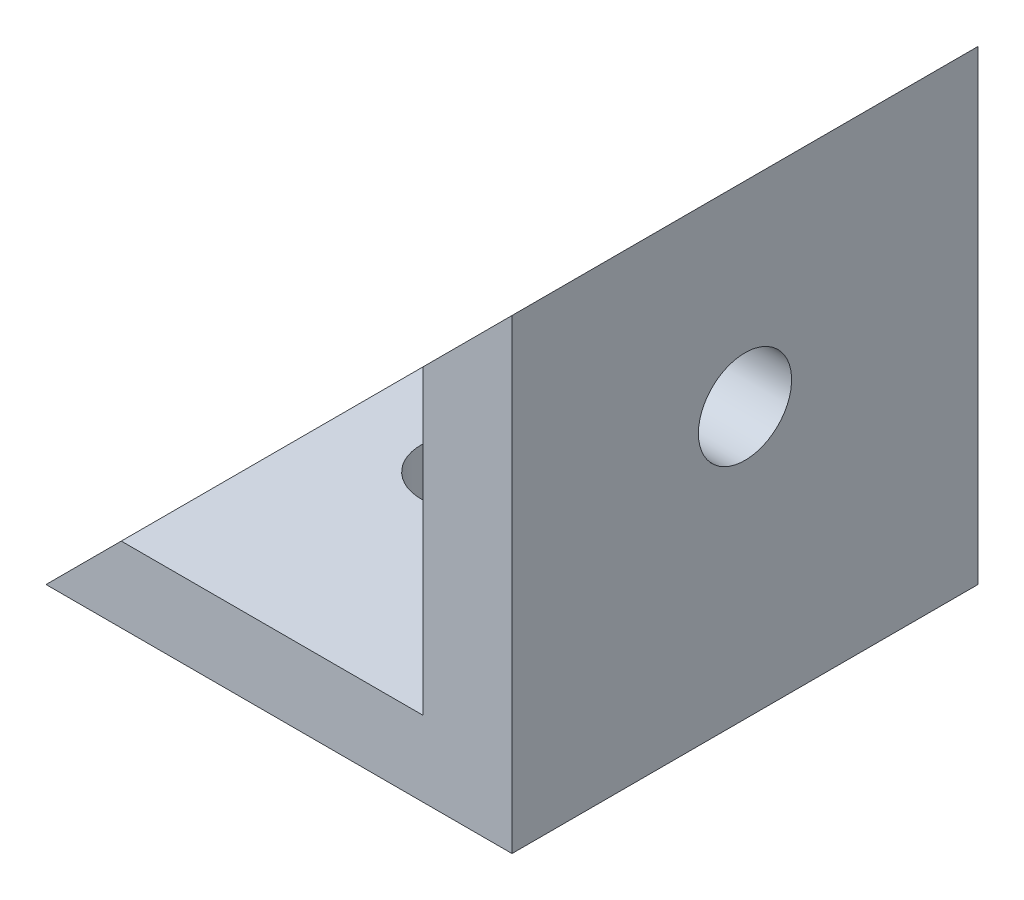
ISO-10303-21;
HEADER;
FILE_DESCRIPTION(('STEP AP214'),'2;1');
FILE_NAME('part.step','',(''),(''),'','','');
FILE_SCHEMA(('AUTOMOTIVE_DESIGN { 1 0 10303 214 1 1 1 1 }'));
ENDSEC;
DATA;
#1=APPLICATION_CONTEXT('core data for automotive mechanical design processes');
#2=APPLICATION_PROTOCOL_DEFINITION('international standard','automotive_design',2000,#1);
#3=PRODUCT_CONTEXT('',#1,'mechanical');
#4=PRODUCT('Part','Part','',(#3));
#5=PRODUCT_RELATED_PRODUCT_CATEGORY('part','',(#4));
#6=PRODUCT_DEFINITION_FORMATION('','',#4);
#7=PRODUCT_DEFINITION_CONTEXT('part definition',#1,'design');
#8=PRODUCT_DEFINITION('design','',#6,#7);
#9=PRODUCT_DEFINITION_SHAPE('','',#8);
#10=(LENGTH_UNIT() NAMED_UNIT(*) SI_UNIT(.MILLI.,.METRE.));
#11=(NAMED_UNIT(*) PLANE_ANGLE_UNIT() SI_UNIT($,.RADIAN.));
#12=(NAMED_UNIT(*) SI_UNIT($,.STERADIAN.) SOLID_ANGLE_UNIT());
#13=UNCERTAINTY_MEASURE_WITH_UNIT(LENGTH_MEASURE(1.E-05),#10,'distance_accuracy_value','');
#14=(GEOMETRIC_REPRESENTATION_CONTEXT(3) GLOBAL_UNCERTAINTY_ASSIGNED_CONTEXT((#13)) GLOBAL_UNIT_ASSIGNED_CONTEXT((#10,
#11,#12)) REPRESENTATION_CONTEXT('',''));
#15=CARTESIAN_POINT('',(0.,0.,0.));
#16=DIRECTION('',(0.,0.,1.));
#17=DIRECTION('',(1.,0.,0.));
#18=AXIS2_PLACEMENT_3D('',#15,#16,#17);
#19=CARTESIAN_POINT('',(-3.17275641148481,4.37791702596532,0.));
#20=DIRECTION('',(0.707106781186548,-0.707106781186548,0.));
#21=DIRECTION('',(0.707106781186548,0.707106781186548,0.));
#22=AXIS2_PLACEMENT_3D('',#19,#20,#21);
#23=PLANE('',#22);
#24=DIRECTION('',(0.,0.,1.));
#25=VECTOR('',#24,1.);
#26=CARTESIAN_POINT('',(-19.9426643462153,-12.3919909087651,0.));
#27=LINE('',#26,#25);
#28=CARTESIAN_POINT('',(-19.9426643462153,-12.3919909087651,0.));
#29=VERTEX_POINT('',#28);
#30=CARTESIAN_POINT('',(-19.9426643462153,-12.3919909087651,20.));
#31=VERTEX_POINT('',#30);
#32=EDGE_CURVE('E56',#29,#31,#27,.T.);
#33=ORIENTED_EDGE('',*,*,#32,.F.);
#34=DIRECTION('',(0.707106781186548,0.707106781186548,0.));
#35=VECTOR('',#34,1.);
#36=CARTESIAN_POINT('',(-3.17275641148481,4.37791702596532,0.));
#37=LINE('',#36,#35);
#38=CARTESIAN_POINT('',(-23.1727564114848,-15.6220829740347,0.));
#39=VERTEX_POINT('',#38);
#40=EDGE_CURVE('E93',#39,#29,#37,.T.);
#41=ORIENTED_EDGE('',*,*,#40,.F.);
#42=DIRECTION('',(0.,0.,-1.));
#43=VECTOR('',#42,1.);
#44=CARTESIAN_POINT('',(-23.1727564114848,-15.6220829740347,20.));
#45=LINE('',#44,#43);
#46=CARTESIAN_POINT('',(-23.1727564114848,-15.6220829740347,20.));
#47=VERTEX_POINT('',#46);
#48=EDGE_CURVE('E101',#47,#39,#45,.T.);
#49=ORIENTED_EDGE('',*,*,#48,.F.);
#50=DIRECTION('',(0.707106781186548,0.707106781186548,0.));
#51=VECTOR('',#50,1.);
#52=CARTESIAN_POINT('',(-3.17275641148481,4.37791702596532,20.));
#53=LINE('',#52,#51);
#54=EDGE_CURVE('E143',#47,#31,#53,.T.);
#55=ORIENTED_EDGE('',*,*,#54,.T.);
#56=EDGE_LOOP('',(#33,#41,#49,#55));
#57=FACE_BOUND('',#56,.T.);
#58=ADVANCED_FACE('F47',(#57),#23,.F.);
#59=CARTESIAN_POINT('',(-23.1727564114848,-15.6220829740347,20.));
#60=DIRECTION('',(0.,1.,0.));
#61=DIRECTION('',(0.,0.,1.));
#62=AXIS2_PLACEMENT_3D('',#59,#60,#61);
#63=PLANE('',#62);
#64=CARTESIAN_POINT('',(-15.0810609763986,-15.6220829740347,10.));
#65=DIRECTION('',(0.,1.,0.));
#66=DIRECTION('',(0.,0.,1.));
#67=AXIS2_PLACEMENT_3D('',#64,#65,#66);
#68=CIRCLE('',#67,2.);
#69=CARTESIAN_POINT('',(-15.0810609763986,-15.6220829740347,12.));
#70=VERTEX_POINT('',#69);
#71=EDGE_CURVE('E205',#70,#70,#68,.T.);
#72=ORIENTED_EDGE('',*,*,#71,.T.);
#73=EDGE_LOOP('',(#72));
#74=FACE_BOUND('',#73,.T.);
#75=DIRECTION('',(1.,0.,0.));
#76=VECTOR('',#75,1.);
#77=CARTESIAN_POINT('',(-23.1727564114848,-15.6220829740347,0.));
#78=LINE('',#77,#76);
#79=CARTESIAN_POINT('',(-3.17275641148481,-15.6220829740347,0.));
#80=VERTEX_POINT('',#79);
#81=EDGE_CURVE('E149',#39,#80,#78,.T.);
#82=ORIENTED_EDGE('',*,*,#81,.T.);
#83=DIRECTION('',(0.,0.,-1.));
#84=VECTOR('',#83,1.);
#85=CARTESIAN_POINT('',(-3.17275641148481,-15.6220829740347,20.));
#86=LINE('',#85,#84);
#87=CARTESIAN_POINT('',(-3.17275641148481,-15.6220829740347,20.));
#88=VERTEX_POINT('',#87);
#89=EDGE_CURVE('E160',#88,#80,#86,.T.);
#90=ORIENTED_EDGE('',*,*,#89,.F.);
#91=DIRECTION('',(1.,0.,0.));
#92=VECTOR('',#91,1.);
#93=CARTESIAN_POINT('',(-23.1727564114848,-15.6220829740347,20.));
#94=LINE('',#93,#92);
#95=EDGE_CURVE('E72',#47,#88,#94,.T.);
#96=ORIENTED_EDGE('',*,*,#95,.F.);
#97=ORIENTED_EDGE('',*,*,#48,.T.);
#98=EDGE_LOOP('',(#82,#90,#96,#97));
#99=FACE_BOUND('',#98,.T.);
#100=ADVANCED_FACE('F169',(#74,#99),#63,.F.);
#101=CARTESIAN_POINT('',(-3.17275641148481,-15.6220829740347,20.));
#102=DIRECTION('',(-1.,0.,0.));
#103=DIRECTION('',(0.,0.,1.));
#104=AXIS2_PLACEMENT_3D('',#101,#102,#103);
#105=PLANE('',#104);
#106=CARTESIAN_POINT('',(-3.17275641148481,-4.00703694139992,10.));
#107=DIRECTION('',(-1.,0.,0.));
#108=DIRECTION('',(0.,0.,1.));
#109=AXIS2_PLACEMENT_3D('',#106,#107,#108);
#110=CIRCLE('',#109,2.);
#111=CARTESIAN_POINT('',(-3.17275641148481,-4.00703694139992,12.));
#112=VERTEX_POINT('',#111);
#113=EDGE_CURVE('E135',#112,#112,#110,.T.);
#114=ORIENTED_EDGE('',*,*,#113,.T.);
#115=EDGE_LOOP('',(#114));
#116=FACE_BOUND('',#115,.T.);
#117=DIRECTION('',(0.,1.,0.));
#118=VECTOR('',#117,1.);
#119=CARTESIAN_POINT('',(-3.17275641148481,-15.6220829740347,0.));
#120=LINE('',#119,#118);
#121=CARTESIAN_POINT('',(-3.17275641148481,4.37791702596532,0.));
#122=VERTEX_POINT('',#121);
#123=EDGE_CURVE('E142',#80,#122,#120,.T.);
#124=ORIENTED_EDGE('',*,*,#123,.T.);
#125=DIRECTION('',(0.,0.,-1.));
#126=VECTOR('',#125,1.);
#127=CARTESIAN_POINT('',(-3.17275641148481,4.37791702596532,20.));
#128=LINE('',#127,#126);
#129=CARTESIAN_POINT('',(-3.17275641148481,4.37791702596532,20.));
#130=VERTEX_POINT('',#129);
#131=EDGE_CURVE('E152',#130,#122,#128,.T.);
#132=ORIENTED_EDGE('',*,*,#131,.F.);
#133=DIRECTION('',(0.,1.,0.));
#134=VECTOR('',#133,1.);
#135=CARTESIAN_POINT('',(-3.17275641148481,-15.6220829740347,20.));
#136=LINE('',#135,#134);
#137=EDGE_CURVE('E146',#88,#130,#136,.T.);
#138=ORIENTED_EDGE('',*,*,#137,.F.);
#139=ORIENTED_EDGE('',*,*,#89,.T.);
#140=EDGE_LOOP('',(#124,#132,#138,#139));
#141=FACE_BOUND('',#140,.T.);
#142=ADVANCED_FACE('F49',(#116,#141),#105,.F.);
#143=CARTESIAN_POINT('',(0.,0.,20.));
#144=DIRECTION('',(0.,0.,1.));
#145=DIRECTION('',(1.,0.,0.));
#146=AXIS2_PLACEMENT_3D('',#143,#144,#145);
#147=PLANE('',#146);
#148=DIRECTION('',(0.,1.,0.));
#149=VECTOR('',#148,1.);
#150=CARTESIAN_POINT('',(-6.98936554131233,-12.3919909087651,20.));
#151=LINE('',#150,#149);
#152=CARTESIAN_POINT('',(-6.98936554131233,-12.3919909087651,20.));
#153=VERTEX_POINT('',#152);
#154=CARTESIAN_POINT('',(-6.98936554131233,0.561307896137794,20.));
#155=VERTEX_POINT('',#154);
#156=EDGE_CURVE('E110',#153,#155,#151,.T.);
#157=ORIENTED_EDGE('',*,*,#156,.F.);
#158=DIRECTION('',(-1.,0.,0.));
#159=VECTOR('',#158,1.);
#160=CARTESIAN_POINT('',(-6.98936554131233,-12.3919909087651,20.));
#161=LINE('',#160,#159);
#162=EDGE_CURVE('E120',#153,#31,#161,.T.);
#163=ORIENTED_EDGE('',*,*,#162,.T.);
#164=ORIENTED_EDGE('',*,*,#54,.F.);
#165=ORIENTED_EDGE('',*,*,#95,.T.);
#166=ORIENTED_EDGE('',*,*,#137,.T.);
#167=EDGE_CURVE('E122',#155,#130,#53,.T.);
#168=ORIENTED_EDGE('',*,*,#167,.F.);
#169=EDGE_LOOP('',(#157,#163,#164,#165,#166,#168));
#170=FACE_BOUND('',#169,.T.);
#171=ADVANCED_FACE('F166',(#170),#147,.T.);
#172=CARTESIAN_POINT('',(0.,0.,0.));
#173=DIRECTION('',(0.,0.,1.));
#174=DIRECTION('',(1.,0.,0.));
#175=AXIS2_PLACEMENT_3D('',#172,#173,#174);
#176=PLANE('',#175);
#177=DIRECTION('',(-1.,0.,0.));
#178=VECTOR('',#177,1.);
#179=CARTESIAN_POINT('',(-6.98936554131233,-12.3919909087651,0.));
#180=LINE('',#179,#178);
#181=CARTESIAN_POINT('',(-6.98936554131233,-12.3919909087651,0.));
#182=VERTEX_POINT('',#181);
#183=EDGE_CURVE('E63',#182,#29,#180,.T.);
#184=ORIENTED_EDGE('',*,*,#183,.F.);
#185=DIRECTION('',(0.,1.,0.));
#186=VECTOR('',#185,1.);
#187=CARTESIAN_POINT('',(-6.98936554131233,-12.3919909087651,0.));
#188=LINE('',#187,#186);
#189=CARTESIAN_POINT('',(-6.98936554131233,0.561307896137794,0.));
#190=VERTEX_POINT('',#189);
#191=EDGE_CURVE('E123',#182,#190,#188,.T.);
#192=ORIENTED_EDGE('',*,*,#191,.T.);
#193=EDGE_CURVE('E86',#190,#122,#37,.T.);
#194=ORIENTED_EDGE('',*,*,#193,.T.);
#195=ORIENTED_EDGE('',*,*,#123,.F.);
#196=ORIENTED_EDGE('',*,*,#81,.F.);
#197=ORIENTED_EDGE('',*,*,#40,.T.);
#198=EDGE_LOOP('',(#184,#192,#194,#195,#196,#197));
#199=FACE_BOUND('',#198,.T.);
#200=ADVANCED_FACE('F128',(#199),#176,.F.);
#201=ORIENTED_EDGE('',*,*,#193,.F.);
#202=DIRECTION('',(0.,0.,1.));
#203=VECTOR('',#202,1.);
#204=CARTESIAN_POINT('',(-6.98936554131233,0.561307896137799,0.));
#205=LINE('',#204,#203);
#206=EDGE_CURVE('E11',#190,#155,#205,.T.);
#207=ORIENTED_EDGE('',*,*,#206,.T.);
#208=ORIENTED_EDGE('',*,*,#167,.T.);
#209=ORIENTED_EDGE('',*,*,#131,.T.);
#210=EDGE_LOOP('',(#201,#207,#208,#209));
#211=FACE_BOUND('',#210,.T.);
#212=ADVANCED_FACE('F171',(#211),#23,.F.);
#213=CARTESIAN_POINT('',(-6.98936554131233,-12.3919909087651,0.));
#214=DIRECTION('',(1.,0.,0.));
#215=DIRECTION('',(0.,0.,-1.));
#216=AXIS2_PLACEMENT_3D('',#213,#214,#215);
#217=PLANE('',#216);
#218=CARTESIAN_POINT('',(-6.98936554131233,-4.00703694139992,10.));
#219=DIRECTION('',(-1.,0.,0.));
#220=DIRECTION('',(0.,0.,1.));
#221=AXIS2_PLACEMENT_3D('',#218,#219,#220);
#222=CIRCLE('',#221,2.);
#223=CARTESIAN_POINT('',(-6.98936554131233,-4.00703694139992,12.));
#224=VERTEX_POINT('',#223);
#225=EDGE_CURVE('E202',#224,#224,#222,.T.);
#226=ORIENTED_EDGE('',*,*,#225,.F.);
#227=EDGE_LOOP('',(#226));
#228=FACE_BOUND('',#227,.T.);
#229=ORIENTED_EDGE('',*,*,#191,.F.);
#230=DIRECTION('',(0.,0.,1.));
#231=VECTOR('',#230,1.);
#232=CARTESIAN_POINT('',(-6.98936554131233,-12.3919909087651,0.));
#233=LINE('',#232,#231);
#234=EDGE_CURVE('E117',#182,#153,#233,.T.);
#235=ORIENTED_EDGE('',*,*,#234,.T.);
#236=ORIENTED_EDGE('',*,*,#156,.T.);
#237=ORIENTED_EDGE('',*,*,#206,.F.);
#238=EDGE_LOOP('',(#229,#235,#236,#237));
#239=FACE_BOUND('',#238,.T.);
#240=ADVANCED_FACE('F125',(#228,#239),#217,.F.);
#241=CARTESIAN_POINT('',(-6.98936554131233,-12.3919909087651,0.));
#242=DIRECTION('',(0.,1.,0.));
#243=DIRECTION('',(0.,0.,1.));
#244=AXIS2_PLACEMENT_3D('',#241,#242,#243);
#245=PLANE('',#244);
#246=CARTESIAN_POINT('',(-15.0810609763986,-12.3919909087651,10.));
#247=DIRECTION('',(0.,1.,0.));
#248=DIRECTION('',(0.,0.,1.));
#249=AXIS2_PLACEMENT_3D('',#246,#247,#248);
#250=CIRCLE('',#249,2.);
#251=CARTESIAN_POINT('',(-15.0810609763986,-12.3919909087651,12.));
#252=VERTEX_POINT('',#251);
#253=EDGE_CURVE('E210',#252,#252,#250,.T.);
#254=ORIENTED_EDGE('',*,*,#253,.F.);
#255=EDGE_LOOP('',(#254));
#256=FACE_BOUND('',#255,.T.);
#257=ORIENTED_EDGE('',*,*,#32,.T.);
#258=ORIENTED_EDGE('',*,*,#162,.F.);
#259=ORIENTED_EDGE('',*,*,#234,.F.);
#260=ORIENTED_EDGE('',*,*,#183,.T.);
#261=EDGE_LOOP('',(#257,#258,#259,#260));
#262=FACE_BOUND('',#261,.T.);
#263=ADVANCED_FACE('F118',(#256,#262),#245,.T.);
#264=CARTESIAN_POINT('',(13.0106344586877,-4.00703694139992,10.));
#265=DIRECTION('',(-1.,0.,0.));
#266=DIRECTION('',(0.,0.,1.));
#267=AXIS2_PLACEMENT_3D('',#264,#265,#266);
#268=CYLINDRICAL_SURFACE('',#267,2.);
#269=ORIENTED_EDGE('',*,*,#225,.T.);
#270=EDGE_LOOP('',(#269));
#271=FACE_BOUND('',#270,.T.);
#272=ORIENTED_EDGE('',*,*,#113,.F.);
#273=EDGE_LOOP('',(#272));
#274=FACE_BOUND('',#273,.T.);
#275=ADVANCED_FACE('F221',(#271,#274),#268,.F.);
#276=CARTESIAN_POINT('',(-15.0810609763986,-22.3919909087651,10.));
#277=DIRECTION('',(0.,1.,0.));
#278=DIRECTION('',(0.,0.,1.));
#279=AXIS2_PLACEMENT_3D('',#276,#277,#278);
#280=CYLINDRICAL_SURFACE('',#279,2.);
#281=ORIENTED_EDGE('',*,*,#253,.T.);
#282=EDGE_LOOP('',(#281));
#283=FACE_BOUND('',#282,.T.);
#284=ORIENTED_EDGE('',*,*,#71,.F.);
#285=EDGE_LOOP('',(#284));
#286=FACE_BOUND('',#285,.T.);
#287=ADVANCED_FACE('F217',(#283,#286),#280,.F.);
#288=CLOSED_SHELL('',(#58,#100,#142,#171,#200,#212,#240,#263,#275,#287));
#289=MANIFOLD_SOLID_BREP('B2',#288);
#290=ADVANCED_BREP_SHAPE_REPRESENTATION('',(#18,#289),#14);
#291=SHAPE_DEFINITION_REPRESENTATION(#9,#290);
ENDSEC;
END-ISO-10303-21;
